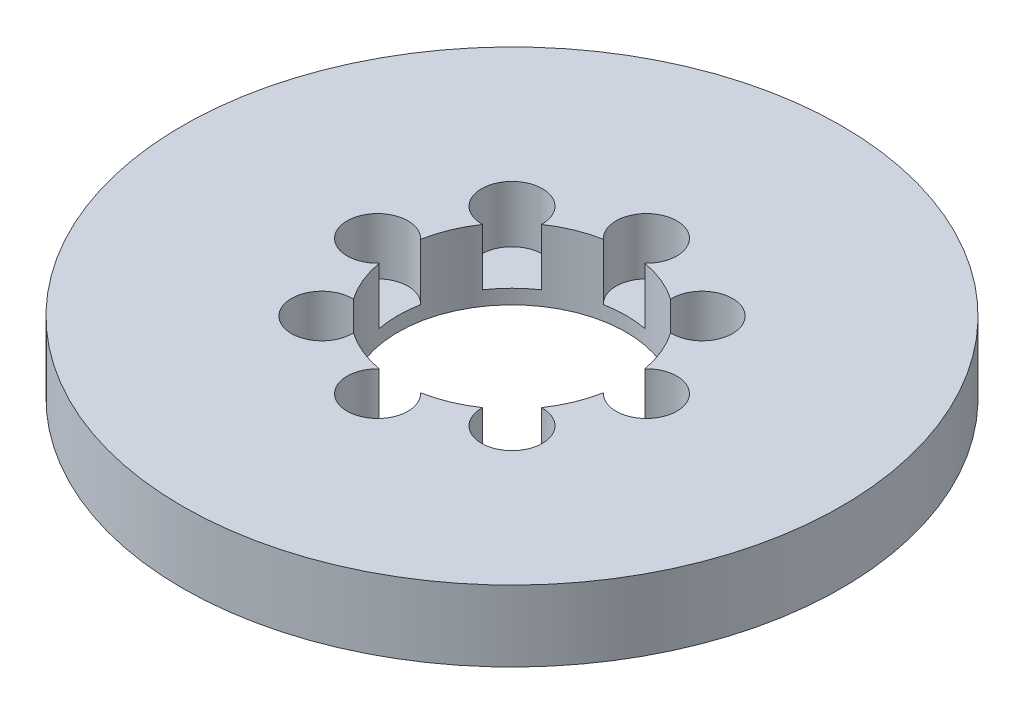
ISO-10303-21;
HEADER;
FILE_DESCRIPTION(('STEP AP214'),'2;1');
FILE_NAME('part.step','',(''),(''),'','','');
FILE_SCHEMA(('AUTOMOTIVE_DESIGN { 1 0 10303 214 1 1 1 1 }'));
ENDSEC;
DATA;
#1=APPLICATION_CONTEXT('core data for automotive mechanical design processes');
#2=APPLICATION_PROTOCOL_DEFINITION('international standard','automotive_design',2000,#1);
#3=PRODUCT_CONTEXT('',#1,'mechanical');
#4=PRODUCT('Part','Part','',(#3));
#5=PRODUCT_RELATED_PRODUCT_CATEGORY('part','',(#4));
#6=PRODUCT_DEFINITION_FORMATION('','',#4);
#7=PRODUCT_DEFINITION_CONTEXT('part definition',#1,'design');
#8=PRODUCT_DEFINITION('design','',#6,#7);
#9=PRODUCT_DEFINITION_SHAPE('','',#8);
#10=(LENGTH_UNIT() NAMED_UNIT(*) SI_UNIT(.MILLI.,.METRE.));
#11=(NAMED_UNIT(*) PLANE_ANGLE_UNIT() SI_UNIT($,.RADIAN.));
#12=(NAMED_UNIT(*) SI_UNIT($,.STERADIAN.) SOLID_ANGLE_UNIT());
#13=UNCERTAINTY_MEASURE_WITH_UNIT(LENGTH_MEASURE(1.E-05),#10,'distance_accuracy_value','');
#14=(GEOMETRIC_REPRESENTATION_CONTEXT(3) GLOBAL_UNCERTAINTY_ASSIGNED_CONTEXT((#13)) GLOBAL_UNIT_ASSIGNED_CONTEXT((#10,
#11,#12)) REPRESENTATION_CONTEXT('',''));
#15=CARTESIAN_POINT('',(0.,0.,0.));
#16=DIRECTION('',(0.,0.,1.));
#17=DIRECTION('',(1.,0.,0.));
#18=AXIS2_PLACEMENT_3D('',#15,#16,#17);
#19=CARTESIAN_POINT('',(0.,14.,0.));
#20=DIRECTION('',(0.,-1.,0.));
#21=DIRECTION('',(0.,0.,-1.));
#22=AXIS2_PLACEMENT_3D('',#19,#20,#21);
#23=CYLINDRICAL_SURFACE('',#22,65.);
#24=CARTESIAN_POINT('',(0.,14.,0.));
#25=DIRECTION('',(0.,1.,0.));
#26=DIRECTION('',(0.,0.,1.));
#27=AXIS2_PLACEMENT_3D('',#24,#25,#26);
#28=CIRCLE('',#27,65.);
#29=CARTESIAN_POINT('',(0.,14.,65.));
#30=VERTEX_POINT('',#29);
#31=EDGE_CURVE('E195',#30,#30,#28,.T.);
#32=ORIENTED_EDGE('',*,*,#31,.F.);
#33=EDGE_LOOP('',(#32));
#34=FACE_BOUND('',#33,.T.);
#35=CARTESIAN_POINT('',(0.,0.,0.));
#36=DIRECTION('',(0.,1.,0.));
#37=DIRECTION('',(0.,0.,1.));
#38=AXIS2_PLACEMENT_3D('',#35,#36,#37);
#39=CIRCLE('',#38,65.);
#40=CARTESIAN_POINT('',(0.,0.,65.));
#41=VERTEX_POINT('',#40);
#42=EDGE_CURVE('E179',#41,#41,#39,.T.);
#43=ORIENTED_EDGE('',*,*,#42,.T.);
#44=EDGE_LOOP('',(#43));
#45=FACE_BOUND('',#44,.T.);
#46=ADVANCED_FACE('F39',(#34,#45),#23,.T.);
#47=CARTESIAN_POINT('',(0.,14.,0.));
#48=DIRECTION('',(0.,1.,0.));
#49=DIRECTION('',(0.,0.,1.));
#50=AXIS2_PLACEMENT_3D('',#47,#48,#49);
#51=PLANE('',#50);
#52=CARTESIAN_POINT('',(0.,14.,26.5191644376777));
#53=DIRECTION('',(0.,1.,0.));
#54=DIRECTION('',(1.,0.,0.));
#55=AXIS2_PLACEMENT_3D('',#52,#53,#54);
#56=CIRCLE('',#55,6.00308175781373);
#57=CARTESIAN_POINT('',(-4.09014847093807,14.,22.1251143609628));
#58=VERTEX_POINT('',#57);
#59=CARTESIAN_POINT('',(4.09014847093822,14.,22.1251143609628));
#60=VERTEX_POINT('',#59);
#61=EDGE_CURVE('E176',#58,#60,#56,.T.);
#62=ORIENTED_EDGE('',*,*,#61,.F.);
#63=CARTESIAN_POINT('',(0.,14.,0.));
#64=DIRECTION('',(0.,1.,0.));
#65=DIRECTION('',(0.,0.,1.));
#66=AXIS2_PLACEMENT_3D('',#63,#64,#65);
#67=CIRCLE('',#66,22.5);
#68=CARTESIAN_POINT('',(-12.7526466793045,14.,18.5369901190248));
#69=VERTEX_POINT('',#68);
#70=EDGE_CURVE('E166',#69,#58,#67,.T.);
#71=ORIENTED_EDGE('',*,*,#70,.F.);
#72=CARTESIAN_POINT('',(-18.751881005283,14.,18.7518810052831));
#73=DIRECTION('',(0.,1.,0.));
#74=DIRECTION('',(0.707106781186549,0.,0.707106781186546));
#75=AXIS2_PLACEMENT_3D('',#72,#73,#74);
#76=CIRCLE('',#75,6.00308175781373);
#77=CARTESIAN_POINT('',(-18.5369901190248,14.,12.7526466793045));
#78=VERTEX_POINT('',#77);
#79=EDGE_CURVE('E147',#78,#69,#76,.T.);
#80=ORIENTED_EDGE('',*,*,#79,.F.);
#81=CARTESIAN_POINT('',(-22.1251143609628,14.,4.09014847093814));
#82=VERTEX_POINT('',#81);
#83=EDGE_CURVE('E180',#82,#78,#67,.T.);
#84=ORIENTED_EDGE('',*,*,#83,.F.);
#85=CARTESIAN_POINT('',(-26.5191644376777,14.,0.));
#86=DIRECTION('',(0.,1.,0.));
#87=DIRECTION('',(0.,0.,1.));
#88=AXIS2_PLACEMENT_3D('',#85,#86,#87);
#89=CIRCLE('',#88,6.00308175781373);
#90=CARTESIAN_POINT('',(-22.1251143609628,14.,-4.09014847093814));
#91=VERTEX_POINT('',#90);
#92=EDGE_CURVE('E186',#91,#82,#89,.T.);
#93=ORIENTED_EDGE('',*,*,#92,.F.);
#94=CARTESIAN_POINT('',(-18.536990119025,14.,-12.7526466793043));
#95=VERTEX_POINT('',#94);
#96=EDGE_CURVE('E182',#95,#91,#67,.T.);
#97=ORIENTED_EDGE('',*,*,#96,.F.);
#98=CARTESIAN_POINT('',(-18.7518810052833,14.,-18.7518810052828));
#99=DIRECTION('',(0.,1.,0.));
#100=DIRECTION('',(-0.707106781186539,0.,0.707106781186556));
#101=AXIS2_PLACEMENT_3D('',#98,#99,#100);
#102=CIRCLE('',#101,6.00308175781373);
#103=CARTESIAN_POINT('',(-12.7526466793047,14.,-18.5369901190247));
#104=VERTEX_POINT('',#103);
#105=EDGE_CURVE('E446',#104,#95,#102,.T.);
#106=ORIENTED_EDGE('',*,*,#105,.F.);
#107=CARTESIAN_POINT('',(-4.09014847093838,14.,-22.1251143609628));
#108=VERTEX_POINT('',#107);
#109=EDGE_CURVE('E452',#108,#104,#67,.T.);
#110=ORIENTED_EDGE('',*,*,#109,.F.);
#111=CARTESIAN_POINT('',(-2.77773503267593E-13,14.,-26.5191644376777));
#112=DIRECTION('',(0.,1.,0.));
#113=DIRECTION('',(-1.,0.,0.));
#114=AXIS2_PLACEMENT_3D('',#111,#112,#113);
#115=CIRCLE('',#114,6.00308175781373);
#116=CARTESIAN_POINT('',(4.09014847093791,14.,-22.1251143609628));
#117=VERTEX_POINT('',#116);
#118=EDGE_CURVE('E477',#117,#108,#115,.T.);
#119=ORIENTED_EDGE('',*,*,#118,.F.);
#120=CARTESIAN_POINT('',(12.7526466793044,14.,-18.5369901190249));
#121=VERTEX_POINT('',#120);
#122=EDGE_CURVE('E460',#121,#117,#67,.T.);
#123=ORIENTED_EDGE('',*,*,#122,.F.);
#124=CARTESIAN_POINT('',(18.7518810052829,14.,-18.7518810052832));
#125=DIRECTION('',(0.,1.,0.));
#126=DIRECTION('',(-0.707106781186554,0.,-0.707106781186541));
#127=AXIS2_PLACEMENT_3D('',#124,#125,#126);
#128=CIRCLE('',#127,6.00308175781373);
#129=CARTESIAN_POINT('',(18.5369901190247,14.,-12.7526466793047));
#130=VERTEX_POINT('',#129);
#131=EDGE_CURVE('E464',#130,#121,#128,.T.);
#132=ORIENTED_EDGE('',*,*,#131,.F.);
#133=CARTESIAN_POINT('',(22.1251143609628,14.,-4.09014847093814));
#134=VERTEX_POINT('',#133);
#135=EDGE_CURVE('E459',#134,#130,#67,.T.);
#136=ORIENTED_EDGE('',*,*,#135,.F.);
#137=CARTESIAN_POINT('',(26.5191644376777,14.,0.));
#138=DIRECTION('',(0.,1.,0.));
#139=DIRECTION('',(0.,0.,-1.));
#140=AXIS2_PLACEMENT_3D('',#137,#138,#139);
#141=CIRCLE('',#140,6.00308175781373);
#142=CARTESIAN_POINT('',(22.1251143609628,14.,4.09014847093814));
#143=VERTEX_POINT('',#142);
#144=EDGE_CURVE('E469',#143,#134,#141,.T.);
#145=ORIENTED_EDGE('',*,*,#144,.F.);
#146=CARTESIAN_POINT('',(18.5369901190249,14.,12.7526466793044));
#147=VERTEX_POINT('',#146);
#148=EDGE_CURVE('E181',#147,#143,#67,.T.);
#149=ORIENTED_EDGE('',*,*,#148,.F.);
#150=CARTESIAN_POINT('',(18.7518810052831,14.,18.751881005283));
#151=DIRECTION('',(0.,1.,0.));
#152=DIRECTION('',(0.707106781186544,0.,-0.707106781186551));
#153=AXIS2_PLACEMENT_3D('',#150,#151,#152);
#154=CIRCLE('',#153,6.00308175781373);
#155=CARTESIAN_POINT('',(12.7526466793046,14.,18.5369901190248));
#156=VERTEX_POINT('',#155);
#157=EDGE_CURVE('E475',#156,#147,#154,.T.);
#158=ORIENTED_EDGE('',*,*,#157,.F.);
#159=EDGE_CURVE('E177',#60,#156,#67,.T.);
#160=ORIENTED_EDGE('',*,*,#159,.F.);
#161=EDGE_LOOP('',(#62,#71,#80,#84,#93,#97,#106,#110,#119,#123,#132,#136,#145,#149,#158,#160));
#162=FACE_BOUND('',#161,.T.);
#163=ORIENTED_EDGE('',*,*,#31,.T.);
#164=EDGE_LOOP('',(#163));
#165=FACE_BOUND('',#164,.T.);
#166=ADVANCED_FACE('F172',(#162,#165),#51,.T.);
#167=CARTESIAN_POINT('',(0.,0.,0.));
#168=DIRECTION('',(0.,1.,0.));
#169=DIRECTION('',(0.,0.,1.));
#170=AXIS2_PLACEMENT_3D('',#167,#168,#169);
#171=PLANE('',#170);
#172=CARTESIAN_POINT('',(0.,0.,0.));
#173=DIRECTION('',(0.,1.,0.));
#174=DIRECTION('',(0.,0.,1.));
#175=AXIS2_PLACEMENT_3D('',#172,#173,#174);
#176=CIRCLE('',#175,22.5);
#177=CARTESIAN_POINT('',(0.,0.,22.5));
#178=VERTEX_POINT('',#177);
#179=EDGE_CURVE('E187',#178,#178,#176,.T.);
#180=ORIENTED_EDGE('',*,*,#179,.T.);
#181=EDGE_LOOP('',(#180));
#182=FACE_BOUND('',#181,.T.);
#183=ORIENTED_EDGE('',*,*,#42,.F.);
#184=EDGE_LOOP('',(#183));
#185=FACE_BOUND('',#184,.T.);
#186=ADVANCED_FACE('F270',(#182,#185),#171,.F.);
#187=CARTESIAN_POINT('',(0.,14.,0.));
#188=DIRECTION('',(0.,-1.,0.));
#189=DIRECTION('',(0.,0.,-1.));
#190=AXIS2_PLACEMENT_3D('',#187,#188,#189);
#191=CYLINDRICAL_SURFACE('',#190,22.5);
#192=DIRECTION('',(0.,1.,0.));
#193=VECTOR('',#192,1.);
#194=CARTESIAN_POINT('',(-4.09014847093806,8.41991498379252,22.1251143609628));
#195=LINE('',#194,#193);
#196=CARTESIAN_POINT('',(-4.09014847093807,2.83982996758503,22.1251143609628));
#197=VERTEX_POINT('',#196);
#198=EDGE_CURVE('E11',#197,#58,#195,.T.);
#199=ORIENTED_EDGE('',*,*,#198,.F.);
#200=CARTESIAN_POINT('',(0.,2.83982996758503,0.));
#201=DIRECTION('',(0.,1.,0.));
#202=DIRECTION('',(0.,0.,1.));
#203=AXIS2_PLACEMENT_3D('',#200,#201,#202);
#204=CIRCLE('',#203,22.5);
#205=CARTESIAN_POINT('',(4.09014847093822,2.83982996758503,22.1251143609628));
#206=VERTEX_POINT('',#205);
#207=EDGE_CURVE('E250',#197,#206,#204,.T.);
#208=ORIENTED_EDGE('',*,*,#207,.T.);
#209=DIRECTION('',(0.,1.,0.));
#210=VECTOR('',#209,1.);
#211=CARTESIAN_POINT('',(4.09014847093822,8.41991498379252,22.1251143609628));
#212=LINE('',#211,#210);
#213=EDGE_CURVE('E46',#60,#206,#212,.F.);
#214=ORIENTED_EDGE('',*,*,#213,.F.);
#215=ORIENTED_EDGE('',*,*,#159,.T.);
#216=DIRECTION('',(0.,1.,0.));
#217=VECTOR('',#216,1.);
#218=CARTESIAN_POINT('',(12.7526466793046,8.41991498379252,18.5369901190248));
#219=LINE('',#218,#217);
#220=CARTESIAN_POINT('',(12.7526466793046,2.83982996758503,18.5369901190248));
#221=VERTEX_POINT('',#220);
#222=EDGE_CURVE('E244',#221,#156,#219,.T.);
#223=ORIENTED_EDGE('',*,*,#222,.F.);
#224=CARTESIAN_POINT('',(0.,2.83982996758503,0.));
#225=DIRECTION('',(0.,1.,0.));
#226=DIRECTION('',(0.,0.,1.));
#227=AXIS2_PLACEMENT_3D('',#224,#225,#226);
#228=CIRCLE('',#227,22.5);
#229=CARTESIAN_POINT('',(18.5369901190249,2.83982996758503,12.7526466793044));
#230=VERTEX_POINT('',#229);
#231=EDGE_CURVE('E238',#221,#230,#228,.T.);
#232=ORIENTED_EDGE('',*,*,#231,.T.);
#233=DIRECTION('',(0.,1.,0.));
#234=VECTOR('',#233,1.);
#235=CARTESIAN_POINT('',(18.5369901190249,8.41991498379252,12.7526466793044));
#236=LINE('',#235,#234);
#237=EDGE_CURVE('E242',#147,#230,#236,.F.);
#238=ORIENTED_EDGE('',*,*,#237,.F.);
#239=ORIENTED_EDGE('',*,*,#148,.T.);
#240=DIRECTION('',(0.,1.,0.));
#241=VECTOR('',#240,1.);
#242=CARTESIAN_POINT('',(22.1251143609628,8.41991498379252,4.09014847093814));
#243=LINE('',#242,#241);
#244=CARTESIAN_POINT('',(22.1251143609628,2.83982996758503,4.09014847093814));
#245=VERTEX_POINT('',#244);
#246=EDGE_CURVE('E236',#245,#143,#243,.T.);
#247=ORIENTED_EDGE('',*,*,#246,.F.);
#248=CARTESIAN_POINT('',(0.,2.83982996758503,0.));
#249=DIRECTION('',(0.,1.,0.));
#250=DIRECTION('',(0.,0.,1.));
#251=AXIS2_PLACEMENT_3D('',#248,#249,#250);
#252=CIRCLE('',#251,22.5);
#253=CARTESIAN_POINT('',(22.1251143609628,2.83982996758503,-4.09014847093814));
#254=VERTEX_POINT('',#253);
#255=EDGE_CURVE('E235',#245,#254,#252,.T.);
#256=ORIENTED_EDGE('',*,*,#255,.T.);
#257=DIRECTION('',(0.,1.,0.));
#258=VECTOR('',#257,1.);
#259=CARTESIAN_POINT('',(22.1251143609628,8.41991498379252,-4.09014847093814));
#260=LINE('',#259,#258);
#261=EDGE_CURVE('E234',#134,#254,#260,.F.);
#262=ORIENTED_EDGE('',*,*,#261,.F.);
#263=ORIENTED_EDGE('',*,*,#135,.T.);
#264=DIRECTION('',(0.,1.,0.));
#265=VECTOR('',#264,1.);
#266=CARTESIAN_POINT('',(18.5369901190247,8.41991498379252,-12.7526466793047));
#267=LINE('',#266,#265);
#268=CARTESIAN_POINT('',(18.5369901190247,2.83982996758503,-12.7526466793047));
#269=VERTEX_POINT('',#268);
#270=EDGE_CURVE('E229',#269,#130,#267,.T.);
#271=ORIENTED_EDGE('',*,*,#270,.F.);
#272=CARTESIAN_POINT('',(0.,2.83982996758503,0.));
#273=DIRECTION('',(0.,1.,0.));
#274=DIRECTION('',(0.,0.,1.));
#275=AXIS2_PLACEMENT_3D('',#272,#273,#274);
#276=CIRCLE('',#275,22.5);
#277=CARTESIAN_POINT('',(12.7526466793044,2.83982996758503,-18.5369901190249));
#278=VERTEX_POINT('',#277);
#279=EDGE_CURVE('E221',#269,#278,#276,.T.);
#280=ORIENTED_EDGE('',*,*,#279,.T.);
#281=DIRECTION('',(0.,1.,0.));
#282=VECTOR('',#281,1.);
#283=CARTESIAN_POINT('',(12.7526466793044,8.41991498379252,-18.5369901190249));
#284=LINE('',#283,#282);
#285=EDGE_CURVE('E230',#121,#278,#284,.F.);
#286=ORIENTED_EDGE('',*,*,#285,.F.);
#287=ORIENTED_EDGE('',*,*,#122,.T.);
#288=DIRECTION('',(0.,1.,0.));
#289=VECTOR('',#288,1.);
#290=CARTESIAN_POINT('',(4.09014847093791,8.41991498379252,-22.1251143609628));
#291=LINE('',#290,#289);
#292=CARTESIAN_POINT('',(4.09014847093791,2.83982996758503,-22.1251143609628));
#293=VERTEX_POINT('',#292);
#294=EDGE_CURVE('E225',#293,#117,#291,.T.);
#295=ORIENTED_EDGE('',*,*,#294,.F.);
#296=CARTESIAN_POINT('',(0.,2.83982996758503,0.));
#297=DIRECTION('',(0.,1.,0.));
#298=DIRECTION('',(0.,0.,1.));
#299=AXIS2_PLACEMENT_3D('',#296,#297,#298);
#300=CIRCLE('',#299,22.5);
#301=CARTESIAN_POINT('',(-4.09014847093838,2.83982996758503,-22.1251143609628));
#302=VERTEX_POINT('',#301);
#303=EDGE_CURVE('E216',#293,#302,#300,.T.);
#304=ORIENTED_EDGE('',*,*,#303,.T.);
#305=DIRECTION('',(0.,1.,0.));
#306=VECTOR('',#305,1.);
#307=CARTESIAN_POINT('',(-4.09014847093837,8.41991498379252,-22.1251143609628));
#308=LINE('',#307,#306);
#309=EDGE_CURVE('E218',#108,#302,#308,.F.);
#310=ORIENTED_EDGE('',*,*,#309,.F.);
#311=ORIENTED_EDGE('',*,*,#109,.T.);
#312=DIRECTION('',(0.,1.,0.));
#313=VECTOR('',#312,1.);
#314=CARTESIAN_POINT('',(-12.7526466793047,8.41991498379252,-18.5369901190247));
#315=LINE('',#314,#313);
#316=CARTESIAN_POINT('',(-12.7526466793047,2.83982996758503,-18.5369901190247));
#317=VERTEX_POINT('',#316);
#318=EDGE_CURVE('E212',#317,#104,#315,.T.);
#319=ORIENTED_EDGE('',*,*,#318,.F.);
#320=CARTESIAN_POINT('',(0.,2.83982996758503,0.));
#321=DIRECTION('',(0.,1.,0.));
#322=DIRECTION('',(0.,0.,1.));
#323=AXIS2_PLACEMENT_3D('',#320,#321,#322);
#324=CIRCLE('',#323,22.5);
#325=CARTESIAN_POINT('',(-18.536990119025,2.83982996758503,-12.7526466793043));
#326=VERTEX_POINT('',#325);
#327=EDGE_CURVE('E208',#317,#326,#324,.T.);
#328=ORIENTED_EDGE('',*,*,#327,.T.);
#329=DIRECTION('',(0.,1.,0.));
#330=VECTOR('',#329,1.);
#331=CARTESIAN_POINT('',(-18.536990119025,8.41991498379252,-12.7526466793043));
#332=LINE('',#331,#330);
#333=EDGE_CURVE('E211',#95,#326,#332,.F.);
#334=ORIENTED_EDGE('',*,*,#333,.F.);
#335=ORIENTED_EDGE('',*,*,#96,.T.);
#336=DIRECTION('',(0.,1.,0.));
#337=VECTOR('',#336,1.);
#338=CARTESIAN_POINT('',(-22.1251143609628,8.41991498379252,-4.09014847093814));
#339=LINE('',#338,#337);
#340=CARTESIAN_POINT('',(-22.1251143609628,2.83982996758503,-4.09014847093814));
#341=VERTEX_POINT('',#340);
#342=EDGE_CURVE('E201',#341,#91,#339,.T.);
#343=ORIENTED_EDGE('',*,*,#342,.F.);
#344=CARTESIAN_POINT('',(0.,2.83982996758503,0.));
#345=DIRECTION('',(0.,1.,0.));
#346=DIRECTION('',(0.,0.,1.));
#347=AXIS2_PLACEMENT_3D('',#344,#345,#346);
#348=CIRCLE('',#347,22.5);
#349=CARTESIAN_POINT('',(-22.1251143609628,2.83982996758503,4.09014847093814));
#350=VERTEX_POINT('',#349);
#351=EDGE_CURVE('E194',#341,#350,#348,.T.);
#352=ORIENTED_EDGE('',*,*,#351,.T.);
#353=DIRECTION('',(0.,1.,0.));
#354=VECTOR('',#353,1.);
#355=CARTESIAN_POINT('',(-22.1251143609628,8.41991498379252,4.09014847093814));
#356=LINE('',#355,#354);
#357=EDGE_CURVE('E199',#82,#350,#356,.F.);
#358=ORIENTED_EDGE('',*,*,#357,.F.);
#359=ORIENTED_EDGE('',*,*,#83,.T.);
#360=DIRECTION('',(0.,1.,0.));
#361=VECTOR('',#360,1.);
#362=CARTESIAN_POINT('',(-18.5369901190248,8.41991498379252,12.7526466793045));
#363=LINE('',#362,#361);
#364=CARTESIAN_POINT('',(-18.5369901190248,2.83982996758503,12.7526466793045));
#365=VERTEX_POINT('',#364);
#366=EDGE_CURVE('E160',#365,#78,#363,.T.);
#367=ORIENTED_EDGE('',*,*,#366,.F.);
#368=CARTESIAN_POINT('',(0.,2.83982996758503,0.));
#369=DIRECTION('',(0.,1.,0.));
#370=DIRECTION('',(0.,0.,1.));
#371=AXIS2_PLACEMENT_3D('',#368,#369,#370);
#372=CIRCLE('',#371,22.5);
#373=CARTESIAN_POINT('',(-12.7526466793045,2.83982996758503,18.5369901190248));
#374=VERTEX_POINT('',#373);
#375=EDGE_CURVE('E168',#365,#374,#372,.T.);
#376=ORIENTED_EDGE('',*,*,#375,.T.);
#377=DIRECTION('',(0.,1.,0.));
#378=VECTOR('',#377,1.);
#379=CARTESIAN_POINT('',(-12.7526466793045,8.41991498379252,18.5369901190248));
#380=LINE('',#379,#378);
#381=EDGE_CURVE('E152',#69,#374,#380,.F.);
#382=ORIENTED_EDGE('',*,*,#381,.F.);
#383=ORIENTED_EDGE('',*,*,#70,.T.);
#384=EDGE_LOOP('',(#199,#208,#214,#215,#223,#232,#238,#239,#247,#256,#262,#263,#271,#280,#286,
#287,#295,#304,#310,#311,#319,#328,#334,#335,#343,#352,#358,#359,#367,#376,#382,#383));
#385=FACE_BOUND('',#384,.T.);
#386=ORIENTED_EDGE('',*,*,#179,.F.);
#387=EDGE_LOOP('',(#386));
#388=FACE_BOUND('',#387,.T.);
#389=ADVANCED_FACE('F170',(#385,#388),#191,.F.);
#390=CARTESIAN_POINT('',(-26.5191644376777,2.83982996758503,0.));
#391=DIRECTION('',(0.,1.,0.));
#392=DIRECTION('',(0.,0.,1.));
#393=AXIS2_PLACEMENT_3D('',#390,#391,#392);
#394=CYLINDRICAL_SURFACE('',#393,6.00308175781373);
#395=ORIENTED_EDGE('',*,*,#342,.T.);
#396=ORIENTED_EDGE('',*,*,#92,.T.);
#397=ORIENTED_EDGE('',*,*,#357,.T.);
#398=CARTESIAN_POINT('',(-26.5191644376777,2.83982996758503,0.));
#399=DIRECTION('',(0.,1.,0.));
#400=DIRECTION('',(0.,0.,1.));
#401=AXIS2_PLACEMENT_3D('',#398,#399,#400);
#402=CIRCLE('',#401,6.00308175781373);
#403=EDGE_CURVE('E191',#341,#350,#402,.T.);
#404=ORIENTED_EDGE('',*,*,#403,.F.);
#405=EDGE_LOOP('',(#395,#396,#397,#404));
#406=FACE_BOUND('',#405,.T.);
#407=ADVANCED_FACE('F279',(#406),#394,.F.);
#408=CARTESIAN_POINT('',(-26.5191644376777,2.83982996758503,0.));
#409=DIRECTION('',(0.,1.,0.));
#410=DIRECTION('',(0.,0.,1.));
#411=AXIS2_PLACEMENT_3D('',#408,#409,#410);
#412=PLANE('',#411);
#413=ORIENTED_EDGE('',*,*,#403,.T.);
#414=ORIENTED_EDGE('',*,*,#351,.F.);
#415=EDGE_LOOP('',(#413,#414));
#416=FACE_BOUND('',#415,.T.);
#417=ADVANCED_FACE('F285',(#416),#412,.T.);
#418=CARTESIAN_POINT('',(-18.751881005283,2.83982996758503,18.7518810052831));
#419=DIRECTION('',(0.,1.,0.));
#420=DIRECTION('',(0.,0.,1.));
#421=AXIS2_PLACEMENT_3D('',#418,#419,#420);
#422=CYLINDRICAL_SURFACE('',#421,6.00308175781373);
#423=ORIENTED_EDGE('',*,*,#366,.T.);
#424=ORIENTED_EDGE('',*,*,#79,.T.);
#425=ORIENTED_EDGE('',*,*,#381,.T.);
#426=CARTESIAN_POINT('',(-18.751881005283,2.83982996758503,18.7518810052831));
#427=DIRECTION('',(0.,1.,0.));
#428=DIRECTION('',(0.707106781186549,0.,0.707106781186546));
#429=AXIS2_PLACEMENT_3D('',#426,#427,#428);
#430=CIRCLE('',#429,6.00308175781373);
#431=EDGE_CURVE('E165',#365,#374,#430,.T.);
#432=ORIENTED_EDGE('',*,*,#431,.F.);
#433=EDGE_LOOP('',(#423,#424,#425,#432));
#434=FACE_BOUND('',#433,.T.);
#435=ADVANCED_FACE('F155',(#434),#422,.F.);
#436=CARTESIAN_POINT('',(-18.751881005283,2.83982996758503,18.7518810052831));
#437=DIRECTION('',(0.,1.,0.));
#438=DIRECTION('',(0.707106781186549,0.,0.707106781186546));
#439=AXIS2_PLACEMENT_3D('',#436,#437,#438);
#440=PLANE('',#439);
#441=ORIENTED_EDGE('',*,*,#431,.T.);
#442=ORIENTED_EDGE('',*,*,#375,.F.);
#443=EDGE_LOOP('',(#441,#442));
#444=FACE_BOUND('',#443,.T.);
#445=ADVANCED_FACE('F288',(#444),#440,.T.);
#446=CARTESIAN_POINT('',(-18.7518810052833,2.83982996758503,-18.7518810052828));
#447=DIRECTION('',(0.,1.,0.));
#448=DIRECTION('',(0.,0.,1.));
#449=AXIS2_PLACEMENT_3D('',#446,#447,#448);
#450=CYLINDRICAL_SURFACE('',#449,6.00308175781373);
#451=ORIENTED_EDGE('',*,*,#318,.T.);
#452=ORIENTED_EDGE('',*,*,#105,.T.);
#453=ORIENTED_EDGE('',*,*,#333,.T.);
#454=CARTESIAN_POINT('',(-18.7518810052833,2.83982996758503,-18.7518810052828));
#455=DIRECTION('',(0.,1.,0.));
#456=DIRECTION('',(-0.707106781186539,0.,0.707106781186556));
#457=AXIS2_PLACEMENT_3D('',#454,#455,#456);
#458=CIRCLE('',#457,6.00308175781373);
#459=EDGE_CURVE('E447',#317,#326,#458,.T.);
#460=ORIENTED_EDGE('',*,*,#459,.F.);
#461=EDGE_LOOP('',(#451,#452,#453,#460));
#462=FACE_BOUND('',#461,.T.);
#463=ADVANCED_FACE('F295',(#462),#450,.F.);
#464=CARTESIAN_POINT('',(-18.7518810052833,2.83982996758503,-18.7518810052828));
#465=DIRECTION('',(0.,1.,0.));
#466=DIRECTION('',(-0.707106781186539,0.,0.707106781186556));
#467=AXIS2_PLACEMENT_3D('',#464,#465,#466);
#468=PLANE('',#467);
#469=ORIENTED_EDGE('',*,*,#459,.T.);
#470=ORIENTED_EDGE('',*,*,#327,.F.);
#471=EDGE_LOOP('',(#469,#470));
#472=FACE_BOUND('',#471,.T.);
#473=ADVANCED_FACE('F375',(#472),#468,.T.);
#474=CARTESIAN_POINT('',(-2.77773503267593E-13,2.83982996758503,-26.5191644376777));
#475=DIRECTION('',(0.,1.,0.));
#476=DIRECTION('',(0.,0.,1.));
#477=AXIS2_PLACEMENT_3D('',#474,#475,#476);
#478=CYLINDRICAL_SURFACE('',#477,6.00308175781373);
#479=ORIENTED_EDGE('',*,*,#294,.T.);
#480=ORIENTED_EDGE('',*,*,#118,.T.);
#481=ORIENTED_EDGE('',*,*,#309,.T.);
#482=CARTESIAN_POINT('',(-2.77773503267593E-13,2.83982996758503,-26.5191644376777));
#483=DIRECTION('',(0.,1.,0.));
#484=DIRECTION('',(-1.,0.,0.));
#485=AXIS2_PLACEMENT_3D('',#482,#483,#484);
#486=CIRCLE('',#485,6.00308175781373);
#487=EDGE_CURVE('E467',#293,#302,#486,.T.);
#488=ORIENTED_EDGE('',*,*,#487,.F.);
#489=EDGE_LOOP('',(#479,#480,#481,#488));
#490=FACE_BOUND('',#489,.T.);
#491=ADVANCED_FACE('F361',(#490),#478,.F.);
#492=CARTESIAN_POINT('',(-2.77773503267593E-13,2.83982996758503,-26.5191644376777));
#493=DIRECTION('',(0.,1.,0.));
#494=DIRECTION('',(-1.,0.,0.));
#495=AXIS2_PLACEMENT_3D('',#492,#493,#494);
#496=PLANE('',#495);
#497=ORIENTED_EDGE('',*,*,#487,.T.);
#498=ORIENTED_EDGE('',*,*,#303,.F.);
#499=EDGE_LOOP('',(#497,#498));
#500=FACE_BOUND('',#499,.T.);
#501=ADVANCED_FACE('F297',(#500),#496,.T.);
#502=CARTESIAN_POINT('',(18.7518810052829,2.83982996758503,-18.7518810052832));
#503=DIRECTION('',(0.,1.,0.));
#504=DIRECTION('',(0.,0.,1.));
#505=AXIS2_PLACEMENT_3D('',#502,#503,#504);
#506=CYLINDRICAL_SURFACE('',#505,6.00308175781373);
#507=ORIENTED_EDGE('',*,*,#270,.T.);
#508=ORIENTED_EDGE('',*,*,#131,.T.);
#509=ORIENTED_EDGE('',*,*,#285,.T.);
#510=CARTESIAN_POINT('',(18.7518810052829,2.83982996758503,-18.7518810052832));
#511=DIRECTION('',(0.,1.,0.));
#512=DIRECTION('',(-0.707106781186554,0.,-0.707106781186541));
#513=AXIS2_PLACEMENT_3D('',#510,#511,#512);
#514=CIRCLE('',#513,6.00308175781373);
#515=EDGE_CURVE('E470',#269,#278,#514,.T.);
#516=ORIENTED_EDGE('',*,*,#515,.F.);
#517=EDGE_LOOP('',(#507,#508,#509,#516));
#518=FACE_BOUND('',#517,.T.);
#519=ADVANCED_FACE('F294',(#518),#506,.F.);
#520=CARTESIAN_POINT('',(18.7518810052829,2.83982996758503,-18.7518810052832));
#521=DIRECTION('',(0.,1.,0.));
#522=DIRECTION('',(-0.707106781186554,0.,-0.707106781186541));
#523=AXIS2_PLACEMENT_3D('',#520,#521,#522);
#524=PLANE('',#523);
#525=ORIENTED_EDGE('',*,*,#515,.T.);
#526=ORIENTED_EDGE('',*,*,#279,.F.);
#527=EDGE_LOOP('',(#525,#526));
#528=FACE_BOUND('',#527,.T.);
#529=ADVANCED_FACE('F300',(#528),#524,.T.);
#530=CARTESIAN_POINT('',(26.5191644376777,2.83982996758503,0.));
#531=DIRECTION('',(0.,1.,0.));
#532=DIRECTION('',(0.,0.,1.));
#533=AXIS2_PLACEMENT_3D('',#530,#531,#532);
#534=CYLINDRICAL_SURFACE('',#533,6.00308175781373);
#535=ORIENTED_EDGE('',*,*,#246,.T.);
#536=ORIENTED_EDGE('',*,*,#144,.T.);
#537=ORIENTED_EDGE('',*,*,#261,.T.);
#538=CARTESIAN_POINT('',(26.5191644376777,2.83982996758503,0.));
#539=DIRECTION('',(0.,1.,0.));
#540=DIRECTION('',(0.,0.,-1.));
#541=AXIS2_PLACEMENT_3D('',#538,#539,#540);
#542=CIRCLE('',#541,6.00308175781373);
#543=EDGE_CURVE('E472',#245,#254,#542,.T.);
#544=ORIENTED_EDGE('',*,*,#543,.F.);
#545=EDGE_LOOP('',(#535,#536,#537,#544));
#546=FACE_BOUND('',#545,.T.);
#547=ADVANCED_FACE('F305',(#546),#534,.F.);
#548=CARTESIAN_POINT('',(26.5191644376777,2.83982996758503,0.));
#549=DIRECTION('',(0.,1.,0.));
#550=DIRECTION('',(0.,0.,-1.));
#551=AXIS2_PLACEMENT_3D('',#548,#549,#550);
#552=PLANE('',#551);
#553=ORIENTED_EDGE('',*,*,#543,.T.);
#554=ORIENTED_EDGE('',*,*,#255,.F.);
#555=EDGE_LOOP('',(#553,#554));
#556=FACE_BOUND('',#555,.T.);
#557=ADVANCED_FACE('F308',(#556),#552,.T.);
#558=CARTESIAN_POINT('',(18.7518810052831,2.83982996758503,18.751881005283));
#559=DIRECTION('',(0.,1.,0.));
#560=DIRECTION('',(0.,0.,1.));
#561=AXIS2_PLACEMENT_3D('',#558,#559,#560);
#562=CYLINDRICAL_SURFACE('',#561,6.00308175781373);
#563=ORIENTED_EDGE('',*,*,#222,.T.);
#564=ORIENTED_EDGE('',*,*,#157,.T.);
#565=ORIENTED_EDGE('',*,*,#237,.T.);
#566=CARTESIAN_POINT('',(18.7518810052831,2.83982996758503,18.751881005283));
#567=DIRECTION('',(0.,1.,0.));
#568=DIRECTION('',(0.707106781186544,0.,-0.707106781186551));
#569=AXIS2_PLACEMENT_3D('',#566,#567,#568);
#570=CIRCLE('',#569,6.00308175781373);
#571=EDGE_CURVE('E56',#221,#230,#570,.T.);
#572=ORIENTED_EDGE('',*,*,#571,.F.);
#573=EDGE_LOOP('',(#563,#564,#565,#572));
#574=FACE_BOUND('',#573,.T.);
#575=ADVANCED_FACE('F309',(#574),#562,.F.);
#576=CARTESIAN_POINT('',(18.7518810052831,2.83982996758503,18.751881005283));
#577=DIRECTION('',(0.,1.,0.));
#578=DIRECTION('',(0.707106781186544,0.,-0.707106781186551));
#579=AXIS2_PLACEMENT_3D('',#576,#577,#578);
#580=PLANE('',#579);
#581=ORIENTED_EDGE('',*,*,#571,.T.);
#582=ORIENTED_EDGE('',*,*,#231,.F.);
#583=EDGE_LOOP('',(#581,#582));
#584=FACE_BOUND('',#583,.T.);
#585=ADVANCED_FACE('F256',(#584),#580,.T.);
#586=CARTESIAN_POINT('',(0.,2.83982996758503,26.5191644376777));
#587=DIRECTION('',(0.,1.,0.));
#588=DIRECTION('',(0.,0.,1.));
#589=AXIS2_PLACEMENT_3D('',#586,#587,#588);
#590=CYLINDRICAL_SURFACE('',#589,6.00308175781373);
#591=ORIENTED_EDGE('',*,*,#198,.T.);
#592=ORIENTED_EDGE('',*,*,#61,.T.);
#593=ORIENTED_EDGE('',*,*,#213,.T.);
#594=CARTESIAN_POINT('',(0.,2.83982996758503,26.5191644376777));
#595=DIRECTION('',(0.,1.,0.));
#596=DIRECTION('',(1.,0.,0.));
#597=AXIS2_PLACEMENT_3D('',#594,#595,#596);
#598=CIRCLE('',#597,6.00308175781373);
#599=EDGE_CURVE('E55',#197,#206,#598,.T.);
#600=ORIENTED_EDGE('',*,*,#599,.F.);
#601=EDGE_LOOP('',(#591,#592,#593,#600));
#602=FACE_BOUND('',#601,.T.);
#603=ADVANCED_FACE('F253',(#602),#590,.F.);
#604=CARTESIAN_POINT('',(0.,2.83982996758503,26.5191644376777));
#605=DIRECTION('',(0.,1.,0.));
#606=DIRECTION('',(1.,0.,0.));
#607=AXIS2_PLACEMENT_3D('',#604,#605,#606);
#608=PLANE('',#607);
#609=ORIENTED_EDGE('',*,*,#599,.T.);
#610=ORIENTED_EDGE('',*,*,#207,.F.);
#611=EDGE_LOOP('',(#609,#610));
#612=FACE_BOUND('',#611,.T.);
#613=ADVANCED_FACE('F252',(#612),#608,.T.);
#614=CLOSED_SHELL('',(#46,#166,#186,#389,#407,#417,#435,#445,#463,#473,#491,#501,#519,#529,#547,
#557,#575,#585,#603,#613));
#615=MANIFOLD_SOLID_BREP('B2',#614);
#616=ADVANCED_BREP_SHAPE_REPRESENTATION('',(#18,#615),#14);
#617=SHAPE_DEFINITION_REPRESENTATION(#9,#616);
ENDSEC;
END-ISO-10303-21;
